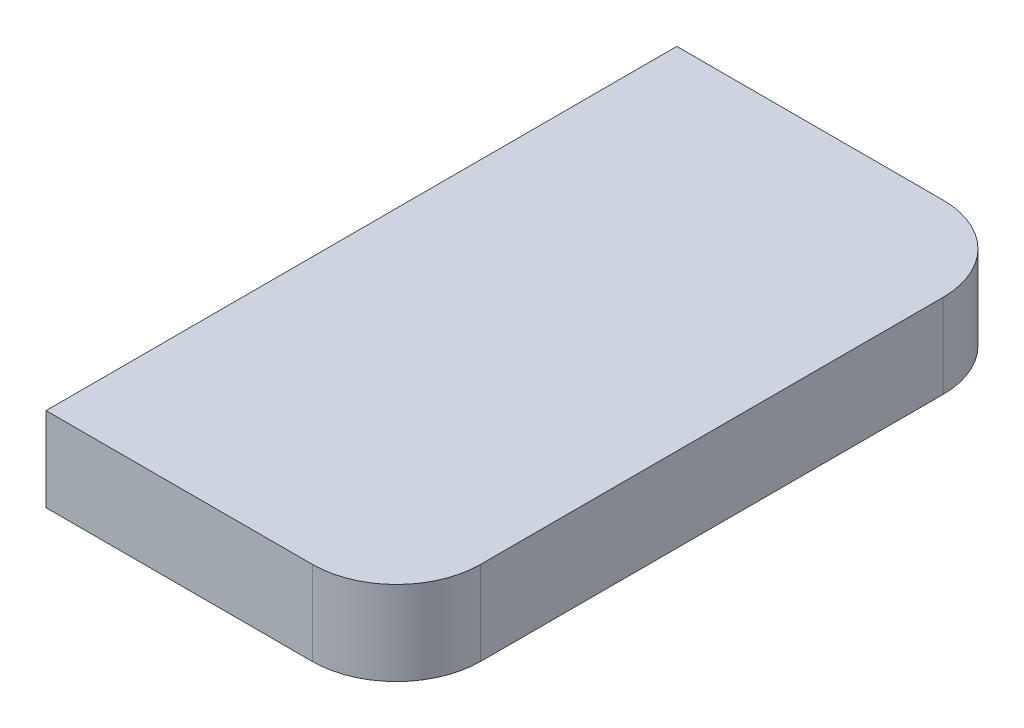
ISO-10303-21;
HEADER;
FILE_DESCRIPTION(('STEP AP214'),'2;1');
FILE_NAME('part.step','',(''),(''),'','','');
FILE_SCHEMA(('AUTOMOTIVE_DESIGN { 1 0 10303 214 1 1 1 1 }'));
ENDSEC;
DATA;
#1=APPLICATION_CONTEXT('core data for automotive mechanical design processes');
#2=APPLICATION_PROTOCOL_DEFINITION('international standard','automotive_design',2000,#1);
#3=PRODUCT_CONTEXT('',#1,'mechanical');
#4=PRODUCT('Part','Part','',(#3));
#5=PRODUCT_RELATED_PRODUCT_CATEGORY('part','',(#4));
#6=PRODUCT_DEFINITION_FORMATION('','',#4);
#7=PRODUCT_DEFINITION_CONTEXT('part definition',#1,'design');
#8=PRODUCT_DEFINITION('design','',#6,#7);
#9=PRODUCT_DEFINITION_SHAPE('','',#8);
#10=(LENGTH_UNIT() NAMED_UNIT(*) SI_UNIT(.MILLI.,.METRE.));
#11=(NAMED_UNIT(*) PLANE_ANGLE_UNIT() SI_UNIT($,.RADIAN.));
#12=(NAMED_UNIT(*) SI_UNIT($,.STERADIAN.) SOLID_ANGLE_UNIT());
#13=UNCERTAINTY_MEASURE_WITH_UNIT(LENGTH_MEASURE(1.E-05),#10,'distance_accuracy_value','');
#14=(GEOMETRIC_REPRESENTATION_CONTEXT(3) GLOBAL_UNCERTAINTY_ASSIGNED_CONTEXT((#13)) GLOBAL_UNIT_ASSIGNED_CONTEXT((#10,
#11,#12)) REPRESENTATION_CONTEXT('',''));
#15=CARTESIAN_POINT('',(0.,0.,0.));
#16=DIRECTION('',(0.,0.,1.));
#17=DIRECTION('',(1.,0.,0.));
#18=AXIS2_PLACEMENT_3D('',#15,#16,#17);
#19=CARTESIAN_POINT('',(0.,10.,0.));
#20=DIRECTION('',(0.,0.,-1.));
#21=DIRECTION('',(-1.,0.,0.));
#22=AXIS2_PLACEMENT_3D('',#19,#20,#21);
#23=PLANE('',#22);
#24=DIRECTION('',(1.,0.,0.));
#25=VECTOR('',#24,1.);
#26=CARTESIAN_POINT('',(0.,10.,0.));
#27=LINE('',#26,#25);
#28=CARTESIAN_POINT('',(58.3339367951012,10.,0.));
#29=VERTEX_POINT('',#28);
#30=CARTESIAN_POINT('',(90.,10.,0.));
#31=VERTEX_POINT('',#30);
#32=EDGE_CURVE('E104',#29,#31,#27,.T.);
#33=ORIENTED_EDGE('',*,*,#32,.F.);
#34=DIRECTION('',(0.,-1.,0.));
#35=VECTOR('',#34,1.);
#36=CARTESIAN_POINT('',(58.3339367951012,10.,0.));
#37=LINE('',#36,#35);
#38=CARTESIAN_POINT('',(58.3339367951012,0.,0.));
#39=VERTEX_POINT('',#38);
#40=EDGE_CURVE('E92',#29,#39,#37,.T.);
#41=ORIENTED_EDGE('',*,*,#40,.T.);
#42=DIRECTION('',(1.,0.,0.));
#43=VECTOR('',#42,1.);
#44=CARTESIAN_POINT('',(0.,0.,0.));
#45=LINE('',#44,#43);
#46=CARTESIAN_POINT('',(90.,0.,0.));
#47=VERTEX_POINT('',#46);
#48=EDGE_CURVE('E101',#39,#47,#45,.T.);
#49=ORIENTED_EDGE('',*,*,#48,.T.);
#50=DIRECTION('',(0.,-1.,0.));
#51=VECTOR('',#50,1.);
#52=CARTESIAN_POINT('',(90.,10.,0.));
#53=LINE('',#52,#51);
#54=EDGE_CURVE('E110',#47,#31,#53,.F.);
#55=ORIENTED_EDGE('',*,*,#54,.T.);
#56=EDGE_LOOP('',(#33,#41,#49,#55));
#57=FACE_BOUND('',#56,.T.);
#58=ADVANCED_FACE('F39',(#57),#23,.F.);
#59=CARTESIAN_POINT('',(100.,10.,0.));
#60=DIRECTION('',(-1.,0.,0.));
#61=DIRECTION('',(0.,0.,1.));
#62=AXIS2_PLACEMENT_3D('',#59,#60,#61);
#63=PLANE('',#62);
#64=DIRECTION('',(0.,0.,-1.));
#65=VECTOR('',#64,1.);
#66=CARTESIAN_POINT('',(100.,0.,0.));
#67=LINE('',#66,#65);
#68=CARTESIAN_POINT('',(100.,0.,-10.));
#69=VERTEX_POINT('',#68);
#70=CARTESIAN_POINT('',(100.,0.,-65.));
#71=VERTEX_POINT('',#70);
#72=EDGE_CURVE('E120',#69,#71,#67,.T.);
#73=ORIENTED_EDGE('',*,*,#72,.T.);
#74=DIRECTION('',(0.,-1.,0.));
#75=VECTOR('',#74,1.);
#76=CARTESIAN_POINT('',(100.,10.,-65.));
#77=LINE('',#76,#75);
#78=CARTESIAN_POINT('',(100.,10.,-65.));
#79=VERTEX_POINT('',#78);
#80=EDGE_CURVE('E11',#71,#79,#77,.F.);
#81=ORIENTED_EDGE('',*,*,#80,.T.);
#82=DIRECTION('',(0.,0.,-1.));
#83=VECTOR('',#82,1.);
#84=CARTESIAN_POINT('',(100.,10.,0.));
#85=LINE('',#84,#83);
#86=CARTESIAN_POINT('',(100.,10.,-10.));
#87=VERTEX_POINT('',#86);
#88=EDGE_CURVE('E113',#87,#79,#85,.T.);
#89=ORIENTED_EDGE('',*,*,#88,.F.);
#90=DIRECTION('',(0.,-1.,0.));
#91=VECTOR('',#90,1.);
#92=CARTESIAN_POINT('',(100.,10.,-10.));
#93=LINE('',#92,#91);
#94=EDGE_CURVE('E48',#87,#69,#93,.T.);
#95=ORIENTED_EDGE('',*,*,#94,.T.);
#96=EDGE_LOOP('',(#73,#81,#89,#95));
#97=FACE_BOUND('',#96,.T.);
#98=ADVANCED_FACE('F154',(#97),#63,.F.);
#99=CARTESIAN_POINT('',(0.,10.,-75.));
#100=DIRECTION('',(0.,0.,1.));
#101=DIRECTION('',(1.,0.,0.));
#102=AXIS2_PLACEMENT_3D('',#99,#100,#101);
#103=PLANE('',#102);
#104=DIRECTION('',(-1.,0.,0.));
#105=VECTOR('',#104,1.);
#106=CARTESIAN_POINT('',(0.,0.,-75.));
#107=LINE('',#106,#105);
#108=CARTESIAN_POINT('',(90.,0.,-75.));
#109=VERTEX_POINT('',#108);
#110=CARTESIAN_POINT('',(58.3339367951012,0.,-75.));
#111=VERTEX_POINT('',#110);
#112=EDGE_CURVE('E114',#109,#111,#107,.T.);
#113=ORIENTED_EDGE('',*,*,#112,.T.);
#114=DIRECTION('',(0.,1.,0.));
#115=VECTOR('',#114,1.);
#116=CARTESIAN_POINT('',(58.3339367951012,10.,-75.));
#117=LINE('',#116,#115);
#118=CARTESIAN_POINT('',(58.3339367951012,10.,-75.));
#119=VERTEX_POINT('',#118);
#120=EDGE_CURVE('E55',#111,#119,#117,.T.);
#121=ORIENTED_EDGE('',*,*,#120,.T.);
#122=DIRECTION('',(-1.,0.,0.));
#123=VECTOR('',#122,1.);
#124=CARTESIAN_POINT('',(0.,10.,-75.));
#125=LINE('',#124,#123);
#126=CARTESIAN_POINT('',(90.,10.,-75.));
#127=VERTEX_POINT('',#126);
#128=EDGE_CURVE('E106',#127,#119,#125,.T.);
#129=ORIENTED_EDGE('',*,*,#128,.F.);
#130=DIRECTION('',(0.,-1.,0.));
#131=VECTOR('',#130,1.);
#132=CARTESIAN_POINT('',(90.,10.,-75.));
#133=LINE('',#132,#131);
#134=EDGE_CURVE('E145',#127,#109,#133,.T.);
#135=ORIENTED_EDGE('',*,*,#134,.T.);
#136=EDGE_LOOP('',(#113,#121,#129,#135));
#137=FACE_BOUND('',#136,.T.);
#138=ADVANCED_FACE('F164',(#137),#103,.F.);
#139=CARTESIAN_POINT('',(0.,10.,0.));
#140=DIRECTION('',(0.,-1.,0.));
#141=DIRECTION('',(0.,0.,-1.));
#142=AXIS2_PLACEMENT_3D('',#139,#140,#141);
#143=PLANE('',#142);
#144=ORIENTED_EDGE('',*,*,#128,.T.);
#145=DIRECTION('',(0.,0.,-1.));
#146=VECTOR('',#145,1.);
#147=CARTESIAN_POINT('',(58.3339367951012,10.,26.0719137206493));
#148=LINE('',#147,#146);
#149=EDGE_CURVE('E95',#29,#119,#148,.T.);
#150=ORIENTED_EDGE('',*,*,#149,.F.);
#151=ORIENTED_EDGE('',*,*,#32,.T.);
#152=CARTESIAN_POINT('',(90.,10.,-10.));
#153=DIRECTION('',(0.,-1.,0.));
#154=DIRECTION('',(0.,0.,-1.));
#155=AXIS2_PLACEMENT_3D('',#152,#153,#154);
#156=CIRCLE('',#155,10.);
#157=EDGE_CURVE('E140',#31,#87,#156,.F.);
#158=ORIENTED_EDGE('',*,*,#157,.T.);
#159=ORIENTED_EDGE('',*,*,#88,.T.);
#160=CARTESIAN_POINT('',(90.,10.,-65.));
#161=DIRECTION('',(0.,-1.,0.));
#162=DIRECTION('',(0.,0.,-1.));
#163=AXIS2_PLACEMENT_3D('',#160,#161,#162);
#164=CIRCLE('',#163,10.);
#165=EDGE_CURVE('E63',#79,#127,#164,.F.);
#166=ORIENTED_EDGE('',*,*,#165,.T.);
#167=EDGE_LOOP('',(#144,#150,#151,#158,#159,#166));
#168=FACE_BOUND('',#167,.T.);
#169=ADVANCED_FACE('F103',(#168),#143,.F.);
#170=CARTESIAN_POINT('',(0.,0.,0.));
#171=DIRECTION('',(0.,-1.,0.));
#172=DIRECTION('',(0.,0.,-1.));
#173=AXIS2_PLACEMENT_3D('',#170,#171,#172);
#174=PLANE('',#173);
#175=DIRECTION('',(0.,0.,-1.));
#176=VECTOR('',#175,1.);
#177=CARTESIAN_POINT('',(58.3339367951012,0.,26.0719137206493));
#178=LINE('',#177,#176);
#179=EDGE_CURVE('E96',#39,#111,#178,.T.);
#180=ORIENTED_EDGE('',*,*,#179,.T.);
#181=ORIENTED_EDGE('',*,*,#112,.F.);
#182=CARTESIAN_POINT('',(90.,0.,-65.));
#183=DIRECTION('',(0.,-1.,0.));
#184=DIRECTION('',(0.,0.,-1.));
#185=AXIS2_PLACEMENT_3D('',#182,#183,#184);
#186=CIRCLE('',#185,10.);
#187=EDGE_CURVE('E137',#109,#71,#186,.T.);
#188=ORIENTED_EDGE('',*,*,#187,.T.);
#189=ORIENTED_EDGE('',*,*,#72,.F.);
#190=CARTESIAN_POINT('',(90.,0.,-10.));
#191=DIRECTION('',(0.,-1.,0.));
#192=DIRECTION('',(0.,0.,-1.));
#193=AXIS2_PLACEMENT_3D('',#190,#191,#192);
#194=CIRCLE('',#193,10.);
#195=EDGE_CURVE('E133',#69,#47,#194,.T.);
#196=ORIENTED_EDGE('',*,*,#195,.T.);
#197=ORIENTED_EDGE('',*,*,#48,.F.);
#198=EDGE_LOOP('',(#180,#181,#188,#189,#196,#197));
#199=FACE_BOUND('',#198,.T.);
#200=ADVANCED_FACE('F158',(#199),#174,.T.);
#201=CARTESIAN_POINT('',(90.,10.,-65.));
#202=DIRECTION('',(0.,-1.,0.));
#203=DIRECTION('',(0.,0.,-1.));
#204=AXIS2_PLACEMENT_3D('',#201,#202,#203);
#205=CYLINDRICAL_SURFACE('',#204,10.);
#206=ORIENTED_EDGE('',*,*,#165,.F.);
#207=ORIENTED_EDGE('',*,*,#80,.F.);
#208=ORIENTED_EDGE('',*,*,#187,.F.);
#209=ORIENTED_EDGE('',*,*,#134,.F.);
#210=EDGE_LOOP('',(#206,#207,#208,#209));
#211=FACE_BOUND('',#210,.T.);
#212=ADVANCED_FACE('F162',(#211),#205,.T.);
#213=CARTESIAN_POINT('',(90.,10.,-10.));
#214=DIRECTION('',(0.,-1.,0.));
#215=DIRECTION('',(0.,0.,-1.));
#216=AXIS2_PLACEMENT_3D('',#213,#214,#215);
#217=CYLINDRICAL_SURFACE('',#216,10.);
#218=ORIENTED_EDGE('',*,*,#157,.F.);
#219=ORIENTED_EDGE('',*,*,#54,.F.);
#220=ORIENTED_EDGE('',*,*,#195,.F.);
#221=ORIENTED_EDGE('',*,*,#94,.F.);
#222=EDGE_LOOP('',(#218,#219,#220,#221));
#223=FACE_BOUND('',#222,.T.);
#224=ADVANCED_FACE('F41',(#223),#217,.T.);
#225=CARTESIAN_POINT('',(58.3339367951012,0.,26.0719137206493));
#226=DIRECTION('',(1.,0.,0.));
#227=DIRECTION('',(0.,0.,-1.));
#228=AXIS2_PLACEMENT_3D('',#225,#226,#227);
#229=PLANE('',#228);
#230=ORIENTED_EDGE('',*,*,#149,.T.);
#231=ORIENTED_EDGE('',*,*,#120,.F.);
#232=ORIENTED_EDGE('',*,*,#179,.F.);
#233=ORIENTED_EDGE('',*,*,#40,.F.);
#234=EDGE_LOOP('',(#230,#231,#232,#233));
#235=FACE_BOUND('',#234,.T.);
#236=ADVANCED_FACE('F94',(#235),#229,.F.);
#237=CLOSED_SHELL('',(#58,#98,#138,#169,#200,#212,#224,#236));
#238=MANIFOLD_SOLID_BREP('B2',#237);
#239=ADVANCED_BREP_SHAPE_REPRESENTATION('',(#18,#238),#14);
#240=SHAPE_DEFINITION_REPRESENTATION(#9,#239);
ENDSEC;
END-ISO-10303-21;
